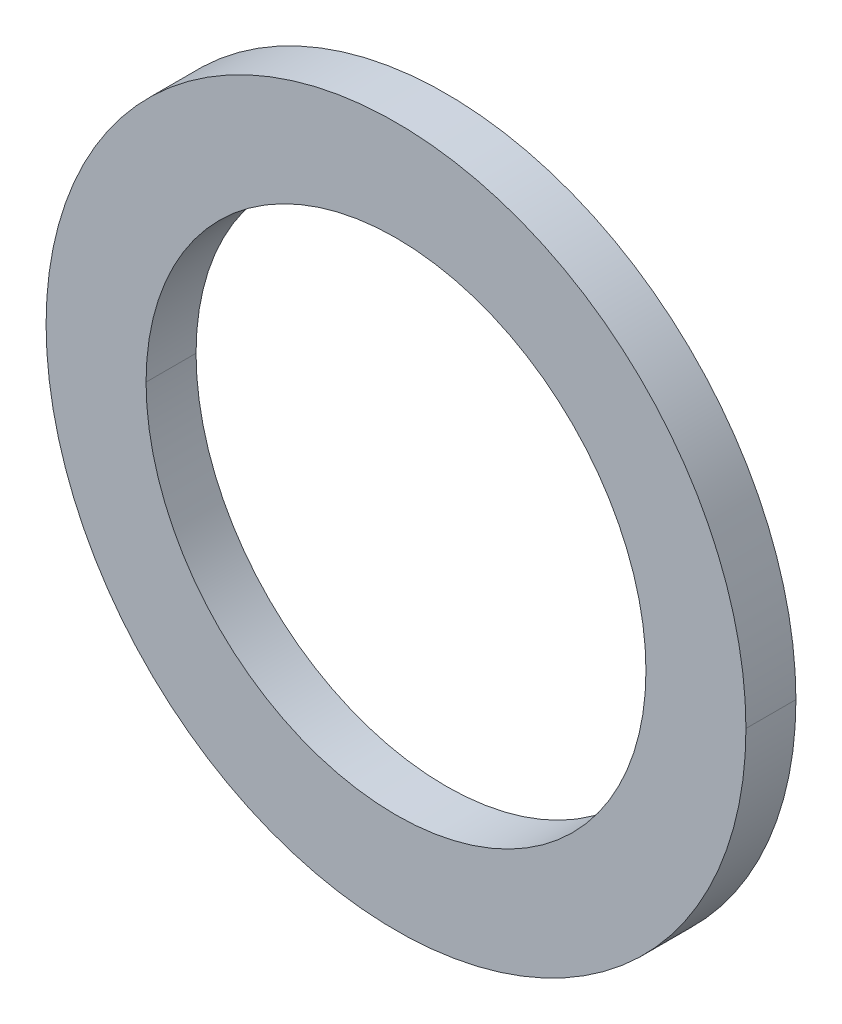
ISO-10303-21;
HEADER;
FILE_DESCRIPTION(('STEP AP214'),'2;1');
FILE_NAME('part.step','',(''),(''),'','','');
FILE_SCHEMA(('AUTOMOTIVE_DESIGN { 1 0 10303 214 1 1 1 1 }'));
ENDSEC;
DATA;
#1=APPLICATION_CONTEXT('core data for automotive mechanical design processes');
#2=APPLICATION_PROTOCOL_DEFINITION('international standard','automotive_design',2000,#1);
#3=PRODUCT_CONTEXT('',#1,'mechanical');
#4=PRODUCT('Part','Part','',(#3));
#5=PRODUCT_RELATED_PRODUCT_CATEGORY('part','',(#4));
#6=PRODUCT_DEFINITION_FORMATION('','',#4);
#7=PRODUCT_DEFINITION_CONTEXT('part definition',#1,'design');
#8=PRODUCT_DEFINITION('design','',#6,#7);
#9=PRODUCT_DEFINITION_SHAPE('','',#8);
#10=(LENGTH_UNIT() NAMED_UNIT(*) SI_UNIT(.MILLI.,.METRE.));
#11=(NAMED_UNIT(*) PLANE_ANGLE_UNIT() SI_UNIT($,.RADIAN.));
#12=(NAMED_UNIT(*) SI_UNIT($,.STERADIAN.) SOLID_ANGLE_UNIT());
#13=UNCERTAINTY_MEASURE_WITH_UNIT(LENGTH_MEASURE(1.E-05),#10,'distance_accuracy_value','');
#14=(GEOMETRIC_REPRESENTATION_CONTEXT(3) GLOBAL_UNCERTAINTY_ASSIGNED_CONTEXT((#13)) GLOBAL_UNIT_ASSIGNED_CONTEXT((#10,
#11,#12)) REPRESENTATION_CONTEXT('',''));
#15=CARTESIAN_POINT('',(0.,0.,0.));
#16=DIRECTION('',(0.,0.,1.));
#17=DIRECTION('',(1.,0.,0.));
#18=AXIS2_PLACEMENT_3D('',#15,#16,#17);
#19=CARTESIAN_POINT('',(0.,0.,0.5));
#20=DIRECTION('',(0.,0.,-1.));
#21=DIRECTION('',(-1.,0.,0.));
#22=AXIS2_PLACEMENT_3D('',#19,#20,#21);
#23=CYLINDRICAL_SURFACE('',#22,2.5);
#24=DIRECTION('',(0.,0.,-1.));
#25=VECTOR('',#24,1.);
#26=CARTESIAN_POINT('',(2.5,0.,0.5));
#27=LINE('',#26,#25);
#28=CARTESIAN_POINT('',(2.5,0.,0.5));
#29=VERTEX_POINT('',#28);
#30=CARTESIAN_POINT('',(2.5,0.,0.));
#31=VERTEX_POINT('',#30);
#32=EDGE_CURVE('E86',#29,#31,#27,.T.);
#33=ORIENTED_EDGE('',*,*,#32,.F.);
#34=CARTESIAN_POINT('',(0.,0.,0.5));
#35=DIRECTION('',(0.,0.,1.));
#36=DIRECTION('',(1.,0.,0.));
#37=AXIS2_PLACEMENT_3D('',#34,#35,#36);
#38=CIRCLE('',#37,2.5);
#39=CARTESIAN_POINT('',(-2.5,0.,0.5));
#40=VERTEX_POINT('',#39);
#41=EDGE_CURVE('E59',#29,#40,#38,.T.);
#42=ORIENTED_EDGE('',*,*,#41,.T.);
#43=DIRECTION('',(0.,0.,-1.));
#44=VECTOR('',#43,1.);
#45=CARTESIAN_POINT('',(-2.5,0.,0.5));
#46=LINE('',#45,#44);
#47=CARTESIAN_POINT('',(-2.5,0.,0.));
#48=VERTEX_POINT('',#47);
#49=EDGE_CURVE('E80',#40,#48,#46,.T.);
#50=ORIENTED_EDGE('',*,*,#49,.T.);
#51=CARTESIAN_POINT('',(0.,0.,0.));
#52=DIRECTION('',(0.,0.,1.));
#53=DIRECTION('',(1.,0.,0.));
#54=AXIS2_PLACEMENT_3D('',#51,#52,#53);
#55=CIRCLE('',#54,2.5);
#56=EDGE_CURVE('E11',#31,#48,#55,.T.);
#57=ORIENTED_EDGE('',*,*,#56,.F.);
#58=EDGE_LOOP('',(#33,#42,#50,#57));
#59=FACE_BOUND('',#58,.T.);
#60=ADVANCED_FACE('F16',(#59),#23,.F.);
#61=CARTESIAN_POINT('',(0.,0.,0.5));
#62=DIRECTION('',(0.,0.,-1.));
#63=DIRECTION('',(-1.,0.,0.));
#64=AXIS2_PLACEMENT_3D('',#61,#62,#63);
#65=CYLINDRICAL_SURFACE('',#64,3.5);
#66=DIRECTION('',(0.,0.,-1.));
#67=VECTOR('',#66,1.);
#68=CARTESIAN_POINT('',(3.5,0.,0.5));
#69=LINE('',#68,#67);
#70=CARTESIAN_POINT('',(3.5,0.,0.5));
#71=VERTEX_POINT('',#70);
#72=CARTESIAN_POINT('',(3.5,0.,0.));
#73=VERTEX_POINT('',#72);
#74=EDGE_CURVE('E116',#71,#73,#69,.T.);
#75=ORIENTED_EDGE('',*,*,#74,.F.);
#76=CARTESIAN_POINT('',(0.,0.,0.5));
#77=DIRECTION('',(0.,0.,1.));
#78=DIRECTION('',(1.,0.,0.));
#79=AXIS2_PLACEMENT_3D('',#76,#77,#78);
#80=CIRCLE('',#79,3.5);
#81=CARTESIAN_POINT('',(-3.5,0.,0.5));
#82=VERTEX_POINT('',#81);
#83=EDGE_CURVE('E98',#82,#71,#80,.T.);
#84=ORIENTED_EDGE('',*,*,#83,.F.);
#85=DIRECTION('',(0.,0.,-1.));
#86=VECTOR('',#85,1.);
#87=CARTESIAN_POINT('',(-3.5,0.,0.5));
#88=LINE('',#87,#86);
#89=CARTESIAN_POINT('',(-3.5,0.,0.));
#90=VERTEX_POINT('',#89);
#91=EDGE_CURVE('E103',#82,#90,#88,.T.);
#92=ORIENTED_EDGE('',*,*,#91,.T.);
#93=CARTESIAN_POINT('',(0.,0.,0.));
#94=DIRECTION('',(0.,0.,1.));
#95=DIRECTION('',(1.,0.,0.));
#96=AXIS2_PLACEMENT_3D('',#93,#94,#95);
#97=CIRCLE('',#96,3.5);
#98=EDGE_CURVE('E27',#90,#73,#97,.T.);
#99=ORIENTED_EDGE('',*,*,#98,.T.);
#100=EDGE_LOOP('',(#75,#84,#92,#99));
#101=FACE_BOUND('',#100,.T.);
#102=ADVANCED_FACE('F18',(#101),#65,.T.);
#103=CARTESIAN_POINT('',(0.,0.,0.));
#104=DIRECTION('',(0.,0.,1.));
#105=DIRECTION('',(1.,0.,0.));
#106=AXIS2_PLACEMENT_3D('',#103,#104,#105);
#107=PLANE('',#106);
#108=CARTESIAN_POINT('',(0.,0.,0.));
#109=DIRECTION('',(0.,0.,1.));
#110=DIRECTION('',(1.,0.,0.));
#111=AXIS2_PLACEMENT_3D('',#108,#109,#110);
#112=CIRCLE('',#111,2.5);
#113=EDGE_CURVE('E78',#48,#31,#112,.T.);
#114=ORIENTED_EDGE('',*,*,#113,.T.);
#115=ORIENTED_EDGE('',*,*,#56,.T.);
#116=EDGE_LOOP('',(#114,#115));
#117=FACE_BOUND('',#116,.T.);
#118=ORIENTED_EDGE('',*,*,#98,.F.);
#119=CARTESIAN_POINT('',(0.,0.,0.));
#120=DIRECTION('',(0.,0.,1.));
#121=DIRECTION('',(1.,0.,0.));
#122=AXIS2_PLACEMENT_3D('',#119,#120,#121);
#123=CIRCLE('',#122,3.5);
#124=EDGE_CURVE('E112',#73,#90,#123,.T.);
#125=ORIENTED_EDGE('',*,*,#124,.F.);
#126=EDGE_LOOP('',(#118,#125));
#127=FACE_BOUND('',#126,.T.);
#128=ADVANCED_FACE('F76',(#117,#127),#107,.F.);
#129=CARTESIAN_POINT('',(0.,0.,0.5));
#130=DIRECTION('',(0.,0.,1.));
#131=DIRECTION('',(1.,0.,0.));
#132=AXIS2_PLACEMENT_3D('',#129,#130,#131);
#133=PLANE('',#132);
#134=CARTESIAN_POINT('',(0.,0.,0.5));
#135=DIRECTION('',(0.,0.,1.));
#136=DIRECTION('',(1.,0.,0.));
#137=AXIS2_PLACEMENT_3D('',#134,#135,#136);
#138=CIRCLE('',#137,2.5);
#139=EDGE_CURVE('E93',#40,#29,#138,.T.);
#140=ORIENTED_EDGE('',*,*,#139,.F.);
#141=ORIENTED_EDGE('',*,*,#41,.F.);
#142=EDGE_LOOP('',(#140,#141));
#143=FACE_BOUND('',#142,.T.);
#144=ORIENTED_EDGE('',*,*,#83,.T.);
#145=CARTESIAN_POINT('',(0.,0.,0.5));
#146=DIRECTION('',(0.,0.,1.));
#147=DIRECTION('',(1.,0.,0.));
#148=AXIS2_PLACEMENT_3D('',#145,#146,#147);
#149=CIRCLE('',#148,3.5);
#150=EDGE_CURVE('E20',#71,#82,#149,.T.);
#151=ORIENTED_EDGE('',*,*,#150,.T.);
#152=EDGE_LOOP('',(#144,#151));
#153=FACE_BOUND('',#152,.T.);
#154=ADVANCED_FACE('F122',(#143,#153),#133,.T.);
#155=CARTESIAN_POINT('',(0.,0.,0.5));
#156=DIRECTION('',(0.,0.,-1.));
#157=DIRECTION('',(-1.,0.,0.));
#158=AXIS2_PLACEMENT_3D('',#155,#156,#157);
#159=CYLINDRICAL_SURFACE('',#158,3.5);
#160=ORIENTED_EDGE('',*,*,#150,.F.);
#161=ORIENTED_EDGE('',*,*,#74,.T.);
#162=ORIENTED_EDGE('',*,*,#124,.T.);
#163=ORIENTED_EDGE('',*,*,#91,.F.);
#164=EDGE_LOOP('',(#160,#161,#162,#163));
#165=FACE_BOUND('',#164,.T.);
#166=ADVANCED_FACE('F124',(#165),#159,.T.);
#167=CARTESIAN_POINT('',(0.,0.,0.5));
#168=DIRECTION('',(0.,0.,-1.));
#169=DIRECTION('',(-1.,0.,0.));
#170=AXIS2_PLACEMENT_3D('',#167,#168,#169);
#171=CYLINDRICAL_SURFACE('',#170,2.5);
#172=ORIENTED_EDGE('',*,*,#139,.T.);
#173=ORIENTED_EDGE('',*,*,#32,.T.);
#174=ORIENTED_EDGE('',*,*,#113,.F.);
#175=ORIENTED_EDGE('',*,*,#49,.F.);
#176=EDGE_LOOP('',(#172,#173,#174,#175));
#177=FACE_BOUND('',#176,.T.);
#178=ADVANCED_FACE('F85',(#177),#171,.F.);
#179=CLOSED_SHELL('',(#60,#102,#128,#154,#166,#178));
#180=MANIFOLD_SOLID_BREP('B1',#179);
#181=ADVANCED_BREP_SHAPE_REPRESENTATION('',(#18,#180),#14);
#182=SHAPE_DEFINITION_REPRESENTATION(#9,#181);
ENDSEC;
END-ISO-10303-21;
